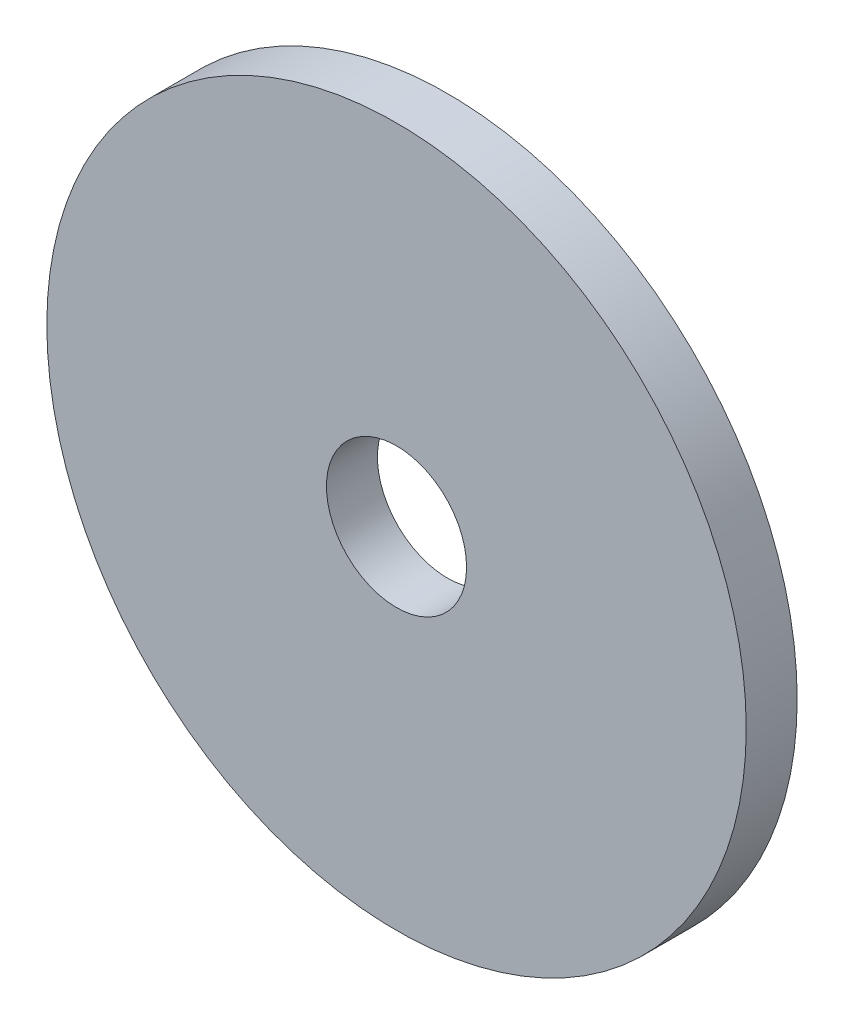
ISO-10303-21;
HEADER;
FILE_DESCRIPTION(('STEP AP214'),'2;1');
FILE_NAME('part.step','',(''),(''),'','','');
FILE_SCHEMA(('AUTOMOTIVE_DESIGN { 1 0 10303 214 1 1 1 1 }'));
ENDSEC;
DATA;
#1=APPLICATION_CONTEXT('core data for automotive mechanical design processes');
#2=APPLICATION_PROTOCOL_DEFINITION('international standard','automotive_design',2000,#1);
#3=PRODUCT_CONTEXT('',#1,'mechanical');
#4=PRODUCT('Part','Part','',(#3));
#5=PRODUCT_RELATED_PRODUCT_CATEGORY('part','',(#4));
#6=PRODUCT_DEFINITION_FORMATION('','',#4);
#7=PRODUCT_DEFINITION_CONTEXT('part definition',#1,'design');
#8=PRODUCT_DEFINITION('design','',#6,#7);
#9=PRODUCT_DEFINITION_SHAPE('','',#8);
#10=(LENGTH_UNIT() NAMED_UNIT(*) SI_UNIT(.MILLI.,.METRE.));
#11=(NAMED_UNIT(*) PLANE_ANGLE_UNIT() SI_UNIT($,.RADIAN.));
#12=(NAMED_UNIT(*) SI_UNIT($,.STERADIAN.) SOLID_ANGLE_UNIT());
#13=UNCERTAINTY_MEASURE_WITH_UNIT(LENGTH_MEASURE(1.E-05),#10,'distance_accuracy_value','');
#14=(GEOMETRIC_REPRESENTATION_CONTEXT(3) GLOBAL_UNCERTAINTY_ASSIGNED_CONTEXT((#13)) GLOBAL_UNIT_ASSIGNED_CONTEXT((#10,
#11,#12)) REPRESENTATION_CONTEXT('',''));
#15=CARTESIAN_POINT('',(0.,0.,0.));
#16=DIRECTION('',(0.,0.,1.));
#17=DIRECTION('',(1.,0.,0.));
#18=AXIS2_PLACEMENT_3D('',#15,#16,#17);
#19=CARTESIAN_POINT('',(0.,0.,1.));
#20=DIRECTION('',(0.,0.,1.));
#21=DIRECTION('',(1.,0.,0.));
#22=AXIS2_PLACEMENT_3D('',#19,#20,#21);
#23=PLANE('',#22);
#24=CARTESIAN_POINT('',(0.,0.,1.));
#25=DIRECTION('',(0.,0.,1.));
#26=DIRECTION('',(1.,0.,0.));
#27=AXIS2_PLACEMENT_3D('',#24,#25,#26);
#28=CIRCLE('',#27,20.5921091631052);
#29=CARTESIAN_POINT('',(20.5921091631052,0.,1.));
#30=VERTEX_POINT('',#29);
#31=EDGE_CURVE('E59',#30,#30,#28,.T.);
#32=ORIENTED_EDGE('',*,*,#31,.F.);
#33=EDGE_LOOP('',(#32));
#34=FACE_BOUND('',#33,.T.);
#35=CARTESIAN_POINT('',(0.,0.,1.));
#36=DIRECTION('',(0.,0.,1.));
#37=DIRECTION('',(1.,0.,0.));
#38=AXIS2_PLACEMENT_3D('',#35,#36,#37);
#39=CIRCLE('',#38,4.125);
#40=CARTESIAN_POINT('',(4.125,0.,1.));
#41=VERTEX_POINT('',#40);
#42=EDGE_CURVE('E55',#41,#41,#39,.T.);
#43=ORIENTED_EDGE('',*,*,#42,.T.);
#44=EDGE_LOOP('',(#43));
#45=FACE_BOUND('',#44,.T.);
#46=ADVANCED_FACE('F51',(#34,#45),#23,.F.);
#47=CARTESIAN_POINT('',(0.,0.,4.));
#48=DIRECTION('',(0.,0.,-1.));
#49=DIRECTION('',(-1.,0.,0.));
#50=AXIS2_PLACEMENT_3D('',#47,#48,#49);
#51=CYLINDRICAL_SURFACE('',#50,20.5921091631052);
#52=CARTESIAN_POINT('',(0.,0.,4.));
#53=DIRECTION('',(0.,0.,1.));
#54=DIRECTION('',(1.,0.,0.));
#55=AXIS2_PLACEMENT_3D('',#52,#53,#54);
#56=CIRCLE('',#55,20.5921091631052);
#57=CARTESIAN_POINT('',(20.5921091631052,0.,4.));
#58=VERTEX_POINT('',#57);
#59=EDGE_CURVE('E11',#58,#58,#56,.T.);
#60=ORIENTED_EDGE('',*,*,#59,.F.);
#61=EDGE_LOOP('',(#60));
#62=FACE_BOUND('',#61,.T.);
#63=ORIENTED_EDGE('',*,*,#31,.T.);
#64=EDGE_LOOP('',(#63));
#65=FACE_BOUND('',#64,.T.);
#66=ADVANCED_FACE('F78',(#62,#65),#51,.T.);
#67=CARTESIAN_POINT('',(0.,0.,4.));
#68=DIRECTION('',(0.,0.,1.));
#69=DIRECTION('',(1.,0.,0.));
#70=AXIS2_PLACEMENT_3D('',#67,#68,#69);
#71=PLANE('',#70);
#72=ORIENTED_EDGE('',*,*,#59,.T.);
#73=EDGE_LOOP('',(#72));
#74=FACE_BOUND('',#73,.T.);
#75=CARTESIAN_POINT('',(0.,0.,4.));
#76=DIRECTION('',(0.,0.,1.));
#77=DIRECTION('',(1.,0.,0.));
#78=AXIS2_PLACEMENT_3D('',#75,#76,#77);
#79=CIRCLE('',#78,4.125);
#80=CARTESIAN_POINT('',(4.125,0.,4.));
#81=VERTEX_POINT('',#80);
#82=EDGE_CURVE('E64',#81,#81,#79,.T.);
#83=ORIENTED_EDGE('',*,*,#82,.F.);
#84=EDGE_LOOP('',(#83));
#85=FACE_BOUND('',#84,.T.);
#86=ADVANCED_FACE('F74',(#74,#85),#71,.T.);
#87=CARTESIAN_POINT('',(0.,0.,4.));
#88=DIRECTION('',(0.,0.,-1.));
#89=DIRECTION('',(-1.,0.,0.));
#90=AXIS2_PLACEMENT_3D('',#87,#88,#89);
#91=CYLINDRICAL_SURFACE('',#90,4.125);
#92=ORIENTED_EDGE('',*,*,#82,.T.);
#93=EDGE_LOOP('',(#92));
#94=FACE_BOUND('',#93,.T.);
#95=ORIENTED_EDGE('',*,*,#42,.F.);
#96=EDGE_LOOP('',(#95));
#97=FACE_BOUND('',#96,.T.);
#98=ADVANCED_FACE('F53',(#94,#97),#91,.F.);
#99=CLOSED_SHELL('',(#46,#66,#86,#98));
#100=MANIFOLD_SOLID_BREP('B2',#99);
#101=ADVANCED_BREP_SHAPE_REPRESENTATION('',(#18,#100),#14);
#102=SHAPE_DEFINITION_REPRESENTATION(#9,#101);
ENDSEC;
END-ISO-10303-21;
